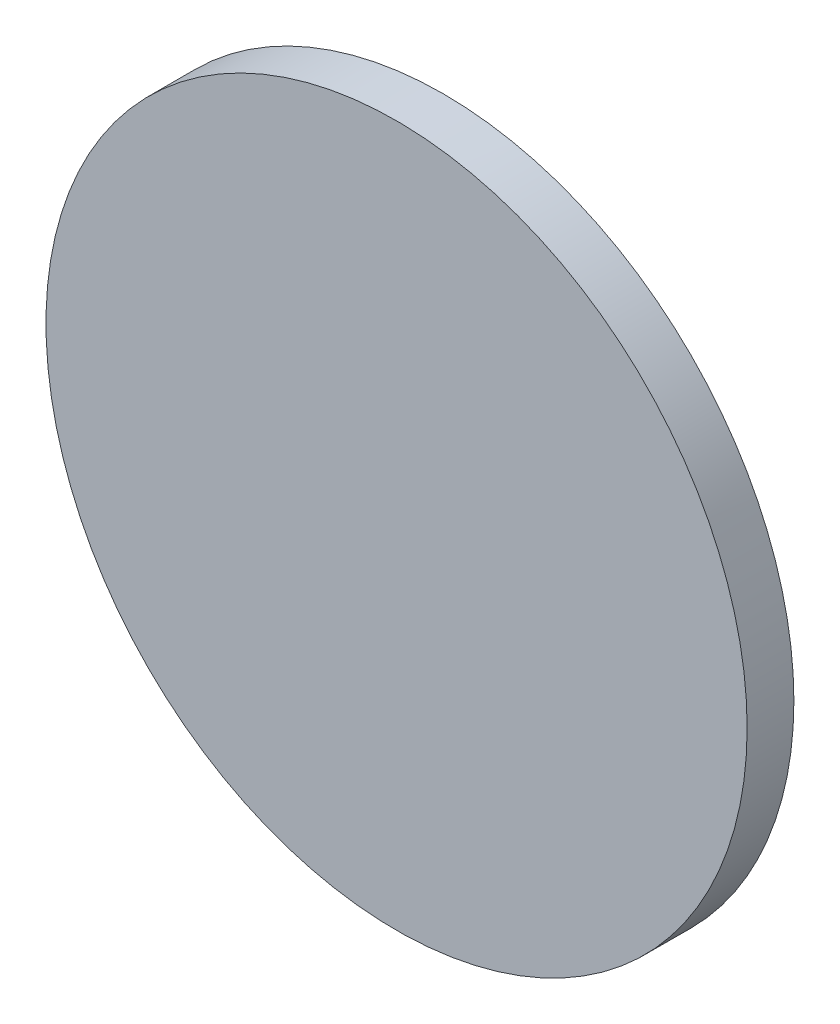
ISO-10303-21;
HEADER;
FILE_DESCRIPTION(('STEP AP214'),'2;1');
FILE_NAME('part.step','',(''),(''),'','','');
FILE_SCHEMA(('AUTOMOTIVE_DESIGN { 1 0 10303 214 1 1 1 1 }'));
ENDSEC;
DATA;
#1=APPLICATION_CONTEXT('core data for automotive mechanical design processes');
#2=APPLICATION_PROTOCOL_DEFINITION('international standard','automotive_design',2000,#1);
#3=PRODUCT_CONTEXT('',#1,'mechanical');
#4=PRODUCT('Part','Part','',(#3));
#5=PRODUCT_RELATED_PRODUCT_CATEGORY('part','',(#4));
#6=PRODUCT_DEFINITION_FORMATION('','',#4);
#7=PRODUCT_DEFINITION_CONTEXT('part definition',#1,'design');
#8=PRODUCT_DEFINITION('design','',#6,#7);
#9=PRODUCT_DEFINITION_SHAPE('','',#8);
#10=(LENGTH_UNIT() NAMED_UNIT(*) SI_UNIT(.MILLI.,.METRE.));
#11=(NAMED_UNIT(*) PLANE_ANGLE_UNIT() SI_UNIT($,.RADIAN.));
#12=(NAMED_UNIT(*) SI_UNIT($,.STERADIAN.) SOLID_ANGLE_UNIT());
#13=UNCERTAINTY_MEASURE_WITH_UNIT(LENGTH_MEASURE(1.E-05),#10,'distance_accuracy_value','');
#14=(GEOMETRIC_REPRESENTATION_CONTEXT(3) GLOBAL_UNCERTAINTY_ASSIGNED_CONTEXT((#13)) GLOBAL_UNIT_ASSIGNED_CONTEXT((#10,
#11,#12)) REPRESENTATION_CONTEXT('',''));
#15=CARTESIAN_POINT('',(0.,0.,0.));
#16=DIRECTION('',(0.,0.,1.));
#17=DIRECTION('',(1.,0.,0.));
#18=AXIS2_PLACEMENT_3D('',#15,#16,#17);
#19=CARTESIAN_POINT('',(0.,0.,0.));
#20=DIRECTION('',(0.,0.,-1.));
#21=DIRECTION('',(-1.,0.,0.));
#22=AXIS2_PLACEMENT_3D('',#19,#20,#21);
#23=PLANE('',#22);
#24=DIRECTION('',(0.,-1.,0.));
#25=VECTOR('',#24,1.);
#26=CARTESIAN_POINT('',(-30.,30.0000000000043,0.));
#27=LINE('',#26,#25);
#28=CARTESIAN_POINT('',(-30.,30.0000000000043,0.));
#29=VERTEX_POINT('',#28);
#30=CARTESIAN_POINT('',(-30.,-30.0000000000043,0.));
#31=VERTEX_POINT('',#30);
#32=EDGE_CURVE('E129',#29,#31,#27,.T.);
#33=ORIENTED_EDGE('',*,*,#32,.F.);
#34=DIRECTION('',(-1.,0.,0.));
#35=VECTOR('',#34,1.);
#36=CARTESIAN_POINT('',(30.,30.0000000000043,0.));
#37=LINE('',#36,#35);
#38=CARTESIAN_POINT('',(30.,30.0000000000043,0.));
#39=VERTEX_POINT('',#38);
#40=EDGE_CURVE('E12',#39,#29,#37,.T.);
#41=ORIENTED_EDGE('',*,*,#40,.F.);
#42=DIRECTION('',(0.,1.,0.));
#43=VECTOR('',#42,1.);
#44=CARTESIAN_POINT('',(30.,30.0000000000043,0.));
#45=LINE('',#44,#43);
#46=CARTESIAN_POINT('',(30.,-30.0000000000043,0.));
#47=VERTEX_POINT('',#46);
#48=EDGE_CURVE('E76',#47,#39,#45,.T.);
#49=ORIENTED_EDGE('',*,*,#48,.F.);
#50=DIRECTION('',(1.,0.,0.));
#51=VECTOR('',#50,1.);
#52=CARTESIAN_POINT('',(30.,-30.0000000000043,0.));
#53=LINE('',#52,#51);
#54=EDGE_CURVE('E161',#31,#47,#53,.T.);
#55=ORIENTED_EDGE('',*,*,#54,.F.);
#56=EDGE_LOOP('',(#33,#41,#49,#55));
#57=FACE_BOUND('',#56,.T.);
#58=ADVANCED_FACE('F66',(#57),#23,.T.);
#59=CARTESIAN_POINT('',(106.066017177974,106.06601717799,49.9999999999991));
#60=CARTESIAN_POINT('',(30.,30.0000000000043,0.));
#61=CARTESIAN_POINT('',(109.191017177975,102.94101717799,49.9999999999991));
#62=CARTESIAN_POINT('',(30.,28.7500000000042,0.));
#63=CARTESIAN_POINT('',(112.235265431033,99.6202265203617,49.9999999999991));
#64=CARTESIAN_POINT('',(30.,27.500000000004,0.));
#65=CARTESIAN_POINT('',(118.099680166964,92.5927096633603,49.9999999999991));
#66=CARTESIAN_POINT('',(30.,25.0000000000036,0.));
#67=CARTESIAN_POINT('',(120.919757392993,88.8859332510844,49.9999999999991));
#68=CARTESIAN_POINT('',(30.,23.7500000000034,0.));
#69=CARTESIAN_POINT('',(126.271003288155,81.1044424584698,49.9999999999991));
#70=CARTESIAN_POINT('',(30.,21.2500000000031,0.));
#71=CARTESIAN_POINT('',(128.802062567297,77.0297020395459,49.9999999999991));
#72=CARTESIAN_POINT('',(30.,20.0000000000029,0.));
#73=CARTESIAN_POINT('',(133.511326145519,68.5439429034832,49.9999999999991));
#74=CARTESIAN_POINT('',(30.,17.5000000000025,0.));
#75=CARTESIAN_POINT('',(135.689408632806,64.1329306847736,49.9999999999991));
#76=CARTESIAN_POINT('',(30.,16.2500000000024,0.));
#77=CARTESIAN_POINT('',(139.633154766966,55.0202735649589,49.9999999999991));
#78=CARTESIAN_POINT('',(30.,13.750000000002,0.));
#79=CARTESIAN_POINT('',(141.398695614746,50.3186731436626,49.9999999999991));
#80=CARTESIAN_POINT('',(30.,12.5000000000018,0.));
#81=CARTESIAN_POINT('',(144.465894233579,40.6837239173444,49.9999999999991));
#82=CARTESIAN_POINT('',(30.,10.0000000000014,0.));
#83=CARTESIAN_POINT('',(145.767442055279,35.7504583133114,49.9999999999991));
#84=CARTESIAN_POINT('',(30.,8.75000000000127,0.));
#85=CARTESIAN_POINT('',(147.866836691358,25.7223840233019,49.9999999999991));
#86=CARTESIAN_POINT('',(30.,6.2500000000009,0.));
#87=CARTESIAN_POINT('',(148.66460040903,20.6276922204669,49.9999999999991));
#88=CARTESIAN_POINT('',(30.,5.00000000000072,0.));
#89=CARTESIAN_POINT('',(149.73120445378,10.3552650347039,49.9999999999991));
#90=CARTESIAN_POINT('',(30.,2.50000000000036,0.));
#91=CARTESIAN_POINT('',(150.,5.17766952966426,49.9999999999991));
#92=CARTESIAN_POINT('',(30.,1.25000000000018,0.));
#93=CARTESIAN_POINT('',(150.,-5.17766952966418,49.9999999999991));
#94=CARTESIAN_POINT('',(30.,-1.25000000000018,0.));
#95=CARTESIAN_POINT('',(149.73120445378,-10.3552650347038,49.9999999999991));
#96=CARTESIAN_POINT('',(30.,-2.50000000000036,0.));
#97=CARTESIAN_POINT('',(148.66460040903,-20.6276922204668,49.9999999999991));
#98=CARTESIAN_POINT('',(30.,-5.00000000000072,0.));
#99=CARTESIAN_POINT('',(147.866836691358,-25.7223840233018,49.9999999999991));
#100=CARTESIAN_POINT('',(30.,-6.2500000000009,0.));
#101=CARTESIAN_POINT('',(145.767442055279,-35.7504583133113,49.9999999999991));
#102=CARTESIAN_POINT('',(30.,-8.75000000000126,0.));
#103=CARTESIAN_POINT('',(144.465894233579,-40.6837239173443,49.9999999999991));
#104=CARTESIAN_POINT('',(30.,-10.0000000000014,0.));
#105=CARTESIAN_POINT('',(141.398695614746,-50.3186731436625,49.9999999999991));
#106=CARTESIAN_POINT('',(30.,-12.5000000000018,0.));
#107=CARTESIAN_POINT('',(139.633154766966,-55.0202735649588,49.9999999999991));
#108=CARTESIAN_POINT('',(30.,-13.750000000002,0.));
#109=CARTESIAN_POINT('',(135.689408632806,-64.1329306847735,49.9999999999991));
#110=CARTESIAN_POINT('',(30.,-16.2500000000024,0.));
#111=CARTESIAN_POINT('',(133.511326145519,-68.5439429034831,49.9999999999991));
#112=CARTESIAN_POINT('',(30.,-17.5000000000025,0.));
#113=CARTESIAN_POINT('',(128.802062567297,-77.0297020395458,49.9999999999991));
#114=CARTESIAN_POINT('',(30.,-20.0000000000029,0.));
#115=CARTESIAN_POINT('',(126.271003288155,-81.1044424584697,49.9999999999991));
#116=CARTESIAN_POINT('',(30.,-21.2500000000031,0.));
#117=CARTESIAN_POINT('',(120.919757392993,-88.8859332510843,49.9999999999991));
#118=CARTESIAN_POINT('',(30.,-23.7500000000034,0.));
#119=CARTESIAN_POINT('',(118.099680166964,-92.5927096633602,49.9999999999991));
#120=CARTESIAN_POINT('',(30.,-25.0000000000036,0.));
#121=CARTESIAN_POINT('',(112.235265431033,-99.6202265203616,49.9999999999991));
#122=CARTESIAN_POINT('',(30.,-27.500000000004,0.));
#123=CARTESIAN_POINT('',(109.191017177975,-102.94101717799,49.9999999999991));
#124=CARTESIAN_POINT('',(30.,-28.7500000000042,0.));
#125=CARTESIAN_POINT('',(106.066017177974,-106.06601717799,49.9999999999991));
#126=CARTESIAN_POINT('',(30.,-30.0000000000043,0.));
#127=B_SPLINE_SURFACE_WITH_KNOTS('',3,1,((#59,#60),(#61,#62),(#63,#64),(#65,#66),(#67,#68),(#69,
#70),(#71,#72),(#73,#74),(#75,#76),(#77,#78),(#79,#80),(#81,#82),(#83,#84),(#85,#86),(#87,#88),
(#89,#90),(#91,#92),(#93,#94),(#95,#96),(#97,#98),(#99,#100),(#101,#102),(#103,#104),(#105,
#106),(#107,#108),(#109,#110),(#111,#112),(#113,#114),(#115,#116),(#117,#118),(#119,#120),(#121,
#122),(#123,#124),(#125,#126)),.UNSPECIFIED.,.F.,.F.,.F.,(4,2,2,2,2,2,2,2,2,2,2,2,2,2,2,2,4),(2,
2),(0.,0.0625,0.125,0.1875,0.25,0.3125,0.375,0.4375,0.5,0.5625,0.625,0.6875,0.75,0.8125,0.875,
0.9375,1.),(0.,1.),.UNSPECIFIED.);
#128=CARTESIAN_POINT('',(0.,0.,49.9999999999991));
#129=DIRECTION('',(0.,0.,1.));
#130=DIRECTION('',(1.,0.,0.));
#131=AXIS2_PLACEMENT_3D('',#128,#129,#130);
#132=CIRCLE('',#131,150.);
#133=CARTESIAN_POINT('',(106.066017177974,-106.06601717799,49.9999999999991));
#134=VERTEX_POINT('',#133);
#135=CARTESIAN_POINT('',(106.066017177974,106.06601717799,49.9999999999991));
#136=VERTEX_POINT('',#135);
#137=EDGE_CURVE('E70',#134,#136,#132,.T.);
#138=DIRECTION('',(-0.641226646308447,0.64122664630854,-0.42149350662605));
#139=VECTOR('',#138,1.);
#140=CARTESIAN_POINT('',(68.0330085889872,-68.0330085889971,24.9999999999996));
#141=LINE('',#140,#139);
#142=EDGE_CURVE('E118',#134,#47,#141,.T.);
#143=DIRECTION('',(0.641226646308447,0.641226646308541,0.42149350662605));
#144=VECTOR('',#143,1.);
#145=CARTESIAN_POINT('',(68.0330085889872,68.0330085889971,24.9999999999996));
#146=LINE('',#145,#144);
#147=EDGE_CURVE('E123',#39,#136,#146,.T.);
#148=ORIENTED_EDGE('',*,*,#137,.F.);
#149=ORIENTED_EDGE('',*,*,#142,.T.);
#150=ORIENTED_EDGE('',*,*,#48,.T.);
#151=ORIENTED_EDGE('',*,*,#147,.T.);
#152=EDGE_LOOP('',(#148,#149,#150,#151));
#153=FACE_BOUND('',#152,.T.);
#154=ADVANCED_FACE('F202',(#153),#127,.T.);
#155=CARTESIAN_POINT('',(106.066017177974,-106.06601717799,49.9999999999991));
#156=CARTESIAN_POINT('',(30.,-30.0000000000043,0.));
#157=CARTESIAN_POINT('',(102.941017177974,-109.191017177989,49.9999999999991));
#158=CARTESIAN_POINT('',(28.75,-30.0000000000043,0.));
#159=CARTESIAN_POINT('',(99.6202265203462,-112.235265431047,49.9999999999991));
#160=CARTESIAN_POINT('',(27.5,-30.0000000000043,0.));
#161=CARTESIAN_POINT('',(92.5927096633452,-118.099680166976,49.9999999999991));
#162=CARTESIAN_POINT('',(25.,-30.0000000000043,0.));
#163=CARTESIAN_POINT('',(88.8859332510695,-120.919757393004,49.9999999999991));
#164=CARTESIAN_POINT('',(23.75,-30.0000000000043,0.));
#165=CARTESIAN_POINT('',(81.1044424584556,-126.271003288164,49.9999999999991));
#166=CARTESIAN_POINT('',(21.25,-30.0000000000043,0.));
#167=CARTESIAN_POINT('',(77.0297020395322,-128.802062567305,49.9999999999991));
#168=CARTESIAN_POINT('',(20.,-30.0000000000043,0.));
#169=CARTESIAN_POINT('',(68.5439429034705,-133.511326145525,49.9999999999991));
#170=CARTESIAN_POINT('',(17.5,-30.0000000000043,0.));
#171=CARTESIAN_POINT('',(64.1329306847616,-135.689408632811,49.9999999999991));
#172=CARTESIAN_POINT('',(16.25,-30.0000000000043,0.));
#173=CARTESIAN_POINT('',(55.0202735649483,-139.633154766971,49.9999999999991));
#174=CARTESIAN_POINT('',(13.75,-30.0000000000043,0.));
#175=CARTESIAN_POINT('',(50.3186731436527,-141.398695614749,49.9999999999991));
#176=CARTESIAN_POINT('',(12.5,-30.0000000000043,0.));
#177=CARTESIAN_POINT('',(40.6837239173362,-144.465894233581,49.9999999999991));
#178=CARTESIAN_POINT('',(10.,-30.0000000000043,0.));
#179=CARTESIAN_POINT('',(35.7504583133042,-145.767442055281,49.9999999999991));
#180=CARTESIAN_POINT('',(8.75000000000001,-30.0000000000043,0.));
#181=CARTESIAN_POINT('',(25.7223840232966,-147.866836691359,49.9999999999991));
#182=CARTESIAN_POINT('',(6.25000000000002,-30.0000000000043,0.));
#183=CARTESIAN_POINT('',(20.6276922204626,-148.66460040903,49.9999999999991));
#184=CARTESIAN_POINT('',(5.00000000000002,-30.0000000000043,0.));
#185=CARTESIAN_POINT('',(10.3552650347017,-149.731204453781,49.9999999999991));
#186=CARTESIAN_POINT('',(2.50000000000002,-30.0000000000043,0.));
#187=CARTESIAN_POINT('',(5.17766952966309,-150.,49.9999999999991));
#188=CARTESIAN_POINT('',(1.25000000000001,-30.0000000000043,0.));
#189=CARTESIAN_POINT('',(-5.17766952966322,-150.,49.9999999999991));
#190=CARTESIAN_POINT('',(-1.24999999999999,-30.0000000000043,0.));
#191=CARTESIAN_POINT('',(-10.3552650347018,-149.731204453781,49.9999999999991));
#192=CARTESIAN_POINT('',(-2.49999999999998,-30.0000000000043,0.));
#193=CARTESIAN_POINT('',(-20.6276922204627,-148.66460040903,49.9999999999991));
#194=CARTESIAN_POINT('',(-4.99999999999996,-30.0000000000043,0.));
#195=CARTESIAN_POINT('',(-25.7223840232967,-147.866836691359,49.9999999999991));
#196=CARTESIAN_POINT('',(-6.24999999999996,-30.0000000000043,0.));
#197=CARTESIAN_POINT('',(-35.7504583133043,-145.767442055281,49.9999999999991));
#198=CARTESIAN_POINT('',(-8.74999999999996,-30.0000000000043,0.));
#199=CARTESIAN_POINT('',(-40.6837239173363,-144.465894233581,49.9999999999991));
#200=CARTESIAN_POINT('',(-9.99999999999996,-30.0000000000043,0.));
#201=CARTESIAN_POINT('',(-50.3186731436528,-141.398695614749,49.9999999999991));
#202=CARTESIAN_POINT('',(-12.5,-30.0000000000043,0.));
#203=CARTESIAN_POINT('',(-55.0202735649484,-139.63315476697,49.9999999999991));
#204=CARTESIAN_POINT('',(-13.75,-30.0000000000043,0.));
#205=CARTESIAN_POINT('',(-64.1329306847617,-135.689408632811,49.9999999999991));
#206=CARTESIAN_POINT('',(-16.25,-30.0000000000043,0.));
#207=CARTESIAN_POINT('',(-68.5439429034706,-133.511326145525,49.9999999999991));
#208=CARTESIAN_POINT('',(-17.5,-30.0000000000043,0.));
#209=CARTESIAN_POINT('',(-77.0297020395323,-128.802062567305,49.9999999999991));
#210=CARTESIAN_POINT('',(-20.,-30.0000000000043,0.));
#211=CARTESIAN_POINT('',(-81.1044424584557,-126.271003288164,49.9999999999991));
#212=CARTESIAN_POINT('',(-21.25,-30.0000000000043,0.));
#213=CARTESIAN_POINT('',(-88.8859332510696,-120.919757393004,49.9999999999991));
#214=CARTESIAN_POINT('',(-23.75,-30.0000000000043,0.));
#215=CARTESIAN_POINT('',(-92.5927096633452,-118.099680166976,49.9999999999991));
#216=CARTESIAN_POINT('',(-25.,-30.0000000000043,0.));
#217=CARTESIAN_POINT('',(-99.6202265203463,-112.235265431047,49.9999999999991));
#218=CARTESIAN_POINT('',(-27.5,-30.0000000000043,0.));
#219=CARTESIAN_POINT('',(-102.941017177974,-109.191017177989,49.9999999999991));
#220=CARTESIAN_POINT('',(-28.75,-30.0000000000043,0.));
#221=CARTESIAN_POINT('',(-106.066017177974,-106.06601717799,49.9999999999991));
#222=CARTESIAN_POINT('',(-30.,-30.0000000000043,0.));
#223=B_SPLINE_SURFACE_WITH_KNOTS('',3,1,((#155,#156),(#157,#158),(#159,#160),(#161,#162),(#163,
#164),(#165,#166),(#167,#168),(#169,#170),(#171,#172),(#173,#174),(#175,#176),(#177,#178),(#179,
#180),(#181,#182),(#183,#184),(#185,#186),(#187,#188),(#189,#190),(#191,#192),(#193,#194),(#195,
#196),(#197,#198),(#199,#200),(#201,#202),(#203,#204),(#205,#206),(#207,#208),(#209,#210),(#211,
#212),(#213,#214),(#215,#216),(#217,#218),(#219,#220),(#221,#222)),.UNSPECIFIED.,.F.,.F.,.F.,(4,
2,2,2,2,2,2,2,2,2,2,2,2,2,2,2,4),(2,2),(0.,0.0624999999999999,0.125,0.1875,0.25,0.3125,0.375,
0.4375,0.5,0.5625,0.625,0.6875,0.75,0.8125,0.875,0.9375,1.),(0.,1.),.UNSPECIFIED.);
#224=CARTESIAN_POINT('',(-106.066017177982,-106.066017177982,49.9999999999991));
#225=VERTEX_POINT('',#224);
#226=EDGE_CURVE('E111',#225,#134,#132,.T.);
#227=DIRECTION('',(0.641226646308447,0.64122664630854,-0.42149350662605));
#228=VECTOR('',#227,1.);
#229=CARTESIAN_POINT('',(-68.0330085889872,-68.033008588997,24.9999999999996));
#230=LINE('',#229,#228);
#231=EDGE_CURVE('E116',#225,#31,#230,.T.);
#232=ORIENTED_EDGE('',*,*,#226,.F.);
#233=ORIENTED_EDGE('',*,*,#231,.T.);
#234=ORIENTED_EDGE('',*,*,#54,.T.);
#235=ORIENTED_EDGE('',*,*,#142,.F.);
#236=EDGE_LOOP('',(#232,#233,#234,#235));
#237=FACE_BOUND('',#236,.T.);
#238=ADVANCED_FACE('F114',(#237),#223,.T.);
#239=CARTESIAN_POINT('',(-106.066017177974,106.06601717799,49.9999999999991));
#240=CARTESIAN_POINT('',(-30.,30.0000000000043,0.));
#241=CARTESIAN_POINT('',(-102.941017177974,109.191017177989,49.9999999999991));
#242=CARTESIAN_POINT('',(-28.75,30.0000000000043,0.));
#243=CARTESIAN_POINT('',(-99.6202265203463,112.235265431047,49.9999999999991));
#244=CARTESIAN_POINT('',(-27.5,30.0000000000043,0.));
#245=CARTESIAN_POINT('',(-92.5927096633452,118.099680166976,49.9999999999991));
#246=CARTESIAN_POINT('',(-25.,30.0000000000043,0.));
#247=CARTESIAN_POINT('',(-88.8859332510696,120.919757393004,49.9999999999991));
#248=CARTESIAN_POINT('',(-23.75,30.0000000000043,0.));
#249=CARTESIAN_POINT('',(-81.1044424584557,126.271003288164,49.9999999999991));
#250=CARTESIAN_POINT('',(-21.25,30.0000000000043,0.));
#251=CARTESIAN_POINT('',(-77.0297020395323,128.802062567305,49.9999999999991));
#252=CARTESIAN_POINT('',(-20.,30.0000000000043,0.));
#253=CARTESIAN_POINT('',(-68.5439429034706,133.511326145525,49.9999999999991));
#254=CARTESIAN_POINT('',(-17.5,30.0000000000043,0.));
#255=CARTESIAN_POINT('',(-64.1329306847617,135.689408632811,49.9999999999991));
#256=CARTESIAN_POINT('',(-16.25,30.0000000000043,0.));
#257=CARTESIAN_POINT('',(-55.0202735649484,139.633154766971,49.9999999999991));
#258=CARTESIAN_POINT('',(-13.75,30.0000000000043,0.));
#259=CARTESIAN_POINT('',(-50.3186731436528,141.398695614749,49.9999999999991));
#260=CARTESIAN_POINT('',(-12.5,30.0000000000043,0.));
#261=CARTESIAN_POINT('',(-40.6837239173363,144.465894233581,49.9999999999991));
#262=CARTESIAN_POINT('',(-9.99999999999997,30.0000000000043,0.));
#263=CARTESIAN_POINT('',(-35.7504583133042,145.767442055281,49.9999999999991));
#264=CARTESIAN_POINT('',(-8.74999999999997,30.0000000000043,0.));
#265=CARTESIAN_POINT('',(-25.7223840232966,147.866836691359,49.9999999999991));
#266=CARTESIAN_POINT('',(-6.24999999999997,30.0000000000043,0.));
#267=CARTESIAN_POINT('',(-20.6276922204627,148.66460040903,49.9999999999991));
#268=CARTESIAN_POINT('',(-4.99999999999997,30.0000000000043,0.));
#269=CARTESIAN_POINT('',(-10.3552650347017,149.731204453781,49.9999999999991));
#270=CARTESIAN_POINT('',(-2.49999999999997,30.0000000000043,0.));
#271=CARTESIAN_POINT('',(-5.17766952966318,150.,49.9999999999991));
#272=CARTESIAN_POINT('',(-1.24999999999997,30.0000000000043,0.));
#273=CARTESIAN_POINT('',(5.17766952966314,150.,49.9999999999991));
#274=CARTESIAN_POINT('',(1.25000000000003,30.0000000000043,0.));
#275=CARTESIAN_POINT('',(10.3552650347017,149.731204453781,49.9999999999991));
#276=CARTESIAN_POINT('',(2.50000000000003,30.0000000000043,0.));
#277=CARTESIAN_POINT('',(20.6276922204626,148.66460040903,49.9999999999991));
#278=CARTESIAN_POINT('',(5.00000000000003,30.0000000000043,0.));
#279=CARTESIAN_POINT('',(25.7223840232966,147.866836691359,49.9999999999991));
#280=CARTESIAN_POINT('',(6.25000000000002,30.0000000000043,0.));
#281=CARTESIAN_POINT('',(35.7504583133042,145.767442055281,49.9999999999991));
#282=CARTESIAN_POINT('',(8.75000000000002,30.0000000000043,0.));
#283=CARTESIAN_POINT('',(40.6837239173363,144.465894233581,49.9999999999991));
#284=CARTESIAN_POINT('',(10.,30.0000000000043,0.));
#285=CARTESIAN_POINT('',(50.3186731436528,141.398695614749,49.9999999999991));
#286=CARTESIAN_POINT('',(12.5,30.0000000000043,0.));
#287=CARTESIAN_POINT('',(55.0202735649483,139.633154766971,49.9999999999991));
#288=CARTESIAN_POINT('',(13.75,30.0000000000043,0.));
#289=CARTESIAN_POINT('',(64.1329306847617,135.689408632811,49.9999999999991));
#290=CARTESIAN_POINT('',(16.25,30.0000000000043,0.));
#291=CARTESIAN_POINT('',(68.5439429034706,133.511326145525,49.9999999999991));
#292=CARTESIAN_POINT('',(17.5,30.0000000000043,0.));
#293=CARTESIAN_POINT('',(77.0297020395322,128.802062567305,49.9999999999991));
#294=CARTESIAN_POINT('',(20.,30.0000000000043,0.));
#295=CARTESIAN_POINT('',(81.1044424584557,126.271003288164,49.9999999999991));
#296=CARTESIAN_POINT('',(21.25,30.0000000000043,0.));
#297=CARTESIAN_POINT('',(88.8859332510695,120.919757393004,49.9999999999991));
#298=CARTESIAN_POINT('',(23.75,30.0000000000043,0.));
#299=CARTESIAN_POINT('',(92.5927096633452,118.099680166976,49.9999999999991));
#300=CARTESIAN_POINT('',(25.,30.0000000000043,0.));
#301=CARTESIAN_POINT('',(99.6202265203463,112.235265431047,49.9999999999991));
#302=CARTESIAN_POINT('',(27.5,30.0000000000043,0.));
#303=CARTESIAN_POINT('',(102.941017177974,109.191017177989,49.9999999999991));
#304=CARTESIAN_POINT('',(28.75,30.0000000000043,0.));
#305=CARTESIAN_POINT('',(106.066017177974,106.06601717799,49.9999999999991));
#306=CARTESIAN_POINT('',(30.,30.0000000000043,0.));
#307=B_SPLINE_SURFACE_WITH_KNOTS('',3,1,((#239,#240),(#241,#242),(#243,#244),(#245,#246),(#247,
#248),(#249,#250),(#251,#252),(#253,#254),(#255,#256),(#257,#258),(#259,#260),(#261,#262),(#263,
#264),(#265,#266),(#267,#268),(#269,#270),(#271,#272),(#273,#274),(#275,#276),(#277,#278),(#279,
#280),(#281,#282),(#283,#284),(#285,#286),(#287,#288),(#289,#290),(#291,#292),(#293,#294),(#295,
#296),(#297,#298),(#299,#300),(#301,#302),(#303,#304),(#305,#306)),.UNSPECIFIED.,.F.,.F.,.F.,(4,
2,2,2,2,2,2,2,2,2,2,2,2,2,2,2,4),(2,2),(0.,0.0624999999999999,0.125,0.1875,0.25,0.3125,0.375,
0.4375,0.5,0.5625,0.625,0.6875,0.75,0.8125,0.875,0.9375,1.),(0.,1.),.UNSPECIFIED.);
#308=CARTESIAN_POINT('',(-106.066017177974,106.06601717799,49.9999999999991));
#309=VERTEX_POINT('',#308);
#310=EDGE_CURVE('E136',#136,#309,#132,.T.);
#311=DIRECTION('',(0.641226646308447,-0.64122664630854,-0.42149350662605));
#312=VECTOR('',#311,1.);
#313=CARTESIAN_POINT('',(-68.0330085889872,68.0330085889971,24.9999999999996));
#314=LINE('',#313,#312);
#315=EDGE_CURVE('E84',#309,#29,#314,.T.);
#316=ORIENTED_EDGE('',*,*,#310,.F.);
#317=ORIENTED_EDGE('',*,*,#147,.F.);
#318=ORIENTED_EDGE('',*,*,#40,.T.);
#319=ORIENTED_EDGE('',*,*,#315,.F.);
#320=EDGE_LOOP('',(#316,#317,#318,#319));
#321=FACE_BOUND('',#320,.T.);
#322=ADVANCED_FACE('F254',(#321),#307,.T.);
#323=CARTESIAN_POINT('',(-106.066017177974,-106.06601717799,49.9999999999991));
#324=CARTESIAN_POINT('',(-30.,-30.0000000000043,0.));
#325=CARTESIAN_POINT('',(-109.191017177975,-102.94101717799,49.9999999999991));
#326=CARTESIAN_POINT('',(-30.,-28.7500000000042,0.));
#327=CARTESIAN_POINT('',(-112.235265431033,-99.6202265203615,49.9999999999991));
#328=CARTESIAN_POINT('',(-30.,-27.500000000004,0.));
#329=CARTESIAN_POINT('',(-118.099680166964,-92.5927096633601,49.9999999999991));
#330=CARTESIAN_POINT('',(-30.,-25.0000000000036,0.));
#331=CARTESIAN_POINT('',(-120.919757392993,-88.8859332510842,49.9999999999991));
#332=CARTESIAN_POINT('',(-30.,-23.7500000000035,0.));
#333=CARTESIAN_POINT('',(-126.271003288155,-81.1044424584696,49.9999999999991));
#334=CARTESIAN_POINT('',(-30.,-21.2500000000031,0.));
#335=CARTESIAN_POINT('',(-128.802062567297,-77.0297020395457,49.9999999999991));
#336=CARTESIAN_POINT('',(-30.,-20.0000000000029,0.));
#337=CARTESIAN_POINT('',(-133.511326145519,-68.543942903483,49.9999999999991));
#338=CARTESIAN_POINT('',(-30.,-17.5000000000026,0.));
#339=CARTESIAN_POINT('',(-135.689408632806,-64.1329306847735,49.9999999999991));
#340=CARTESIAN_POINT('',(-30.,-16.2500000000024,0.));
#341=CARTESIAN_POINT('',(-139.633154766966,-55.0202735649588,49.9999999999991));
#342=CARTESIAN_POINT('',(-30.,-13.7500000000021,0.));
#343=CARTESIAN_POINT('',(-141.398695614746,-50.3186731436625,49.9999999999991));
#344=CARTESIAN_POINT('',(-30.,-12.5000000000019,0.));
#345=CARTESIAN_POINT('',(-144.465894233579,-40.6837239173443,49.9999999999991));
#346=CARTESIAN_POINT('',(-30.,-10.0000000000015,0.));
#347=CARTESIAN_POINT('',(-145.767442055279,-35.7504583133113,49.9999999999991));
#348=CARTESIAN_POINT('',(-30.,-8.75000000000135,0.));
#349=CARTESIAN_POINT('',(-147.866836691358,-25.7223840233017,49.9999999999991));
#350=CARTESIAN_POINT('',(-30.,-6.25000000000099,0.));
#351=CARTESIAN_POINT('',(-148.66460040903,-20.6276922204668,49.9999999999991));
#352=CARTESIAN_POINT('',(-30.,-5.00000000000081,0.));
#353=CARTESIAN_POINT('',(-149.73120445378,-10.3552650347038,49.9999999999991));
#354=CARTESIAN_POINT('',(-30.,-2.50000000000045,0.));
#355=CARTESIAN_POINT('',(-150.,-5.17766952966415,49.9999999999991));
#356=CARTESIAN_POINT('',(-30.,-1.25000000000027,0.));
#357=CARTESIAN_POINT('',(-150.,5.17766952966429,49.9999999999991));
#358=CARTESIAN_POINT('',(-30.,1.25000000000009,0.));
#359=CARTESIAN_POINT('',(-149.73120445378,10.3552650347039,49.9999999999991));
#360=CARTESIAN_POINT('',(-30.,2.50000000000027,0.));
#361=CARTESIAN_POINT('',(-148.66460040903,20.6276922204669,49.9999999999991));
#362=CARTESIAN_POINT('',(-30.,5.00000000000064,0.));
#363=CARTESIAN_POINT('',(-147.866836691358,25.7223840233019,49.9999999999991));
#364=CARTESIAN_POINT('',(-30.,6.25000000000082,0.));
#365=CARTESIAN_POINT('',(-145.767442055279,35.7504583133114,49.9999999999991));
#366=CARTESIAN_POINT('',(-30.,8.75000000000118,0.));
#367=CARTESIAN_POINT('',(-144.465894233579,40.6837239173444,49.9999999999991));
#368=CARTESIAN_POINT('',(-30.,10.0000000000014,0.));
#369=CARTESIAN_POINT('',(-141.398695614746,50.3186731436626,49.9999999999991));
#370=CARTESIAN_POINT('',(-30.,12.5000000000017,0.));
#371=CARTESIAN_POINT('',(-139.633154766966,55.0202735649589,49.9999999999991));
#372=CARTESIAN_POINT('',(-30.,13.7500000000019,0.));
#373=CARTESIAN_POINT('',(-135.689408632806,64.1329306847736,49.9999999999991));
#374=CARTESIAN_POINT('',(-30.,16.2500000000023,0.));
#375=CARTESIAN_POINT('',(-133.511326145519,68.5439429034832,49.9999999999991));
#376=CARTESIAN_POINT('',(-30.,17.5000000000025,0.));
#377=CARTESIAN_POINT('',(-128.802062567297,77.0297020395459,49.9999999999991));
#378=CARTESIAN_POINT('',(-30.,20.0000000000028,0.));
#379=CARTESIAN_POINT('',(-126.271003288155,81.1044424584697,49.9999999999991));
#380=CARTESIAN_POINT('',(-30.,21.250000000003,0.));
#381=CARTESIAN_POINT('',(-120.919757392993,88.8859332510843,49.9999999999991));
#382=CARTESIAN_POINT('',(-30.,23.7500000000034,0.));
#383=CARTESIAN_POINT('',(-118.099680166964,92.5927096633602,49.9999999999991));
#384=CARTESIAN_POINT('',(-30.,25.0000000000036,0.));
#385=CARTESIAN_POINT('',(-112.235265431033,99.6202265203617,49.9999999999991));
#386=CARTESIAN_POINT('',(-30.,27.500000000004,0.));
#387=CARTESIAN_POINT('',(-109.191017177975,102.94101717799,49.9999999999991));
#388=CARTESIAN_POINT('',(-30.,28.7500000000041,0.));
#389=CARTESIAN_POINT('',(-106.066017177974,106.06601717799,49.9999999999991));
#390=CARTESIAN_POINT('',(-30.,30.0000000000043,0.));
#391=B_SPLINE_SURFACE_WITH_KNOTS('',3,1,((#323,#324),(#325,#326),(#327,#328),(#329,#330),(#331,
#332),(#333,#334),(#335,#336),(#337,#338),(#339,#340),(#341,#342),(#343,#344),(#345,#346),(#347,
#348),(#349,#350),(#351,#352),(#353,#354),(#355,#356),(#357,#358),(#359,#360),(#361,#362),(#363,
#364),(#365,#366),(#367,#368),(#369,#370),(#371,#372),(#373,#374),(#375,#376),(#377,#378),(#379,
#380),(#381,#382),(#383,#384),(#385,#386),(#387,#388),(#389,#390)),.UNSPECIFIED.,.F.,.F.,.F.,(4,
2,2,2,2,2,2,2,2,2,2,2,2,2,2,2,4),(2,2),(0.,0.0625,0.125,0.1875,0.25,0.3125,0.375,0.4375,0.5,
0.5625,0.625,0.6875,0.75,0.8125,0.875,0.9375,1.),(0.,1.),.UNSPECIFIED.);
#392=EDGE_CURVE('E127',#309,#225,#132,.T.);
#393=ORIENTED_EDGE('',*,*,#392,.F.);
#394=ORIENTED_EDGE('',*,*,#315,.T.);
#395=ORIENTED_EDGE('',*,*,#32,.T.);
#396=ORIENTED_EDGE('',*,*,#231,.F.);
#397=EDGE_LOOP('',(#393,#394,#395,#396));
#398=FACE_BOUND('',#397,.T.);
#399=ADVANCED_FACE('F126',(#398),#391,.T.);
#400=CARTESIAN_POINT('',(0.,0.,69.9999999999991));
#401=DIRECTION('',(0.,0.,-1.));
#402=DIRECTION('',(-1.,0.,0.));
#403=AXIS2_PLACEMENT_3D('',#400,#401,#402);
#404=CYLINDRICAL_SURFACE('',#403,150.);
#405=ORIENTED_EDGE('',*,*,#310,.T.);
#406=ORIENTED_EDGE('',*,*,#392,.T.);
#407=ORIENTED_EDGE('',*,*,#226,.T.);
#408=ORIENTED_EDGE('',*,*,#137,.T.);
#409=EDGE_LOOP('',(#405,#406,#407,#408));
#410=FACE_BOUND('',#409,.T.);
#411=CARTESIAN_POINT('',(0.,0.,69.9999999999991));
#412=DIRECTION('',(0.,0.,1.));
#413=DIRECTION('',(1.,0.,0.));
#414=AXIS2_PLACEMENT_3D('',#411,#412,#413);
#415=CIRCLE('',#414,150.);
#416=CARTESIAN_POINT('',(150.,0.,69.9999999999991));
#417=VERTEX_POINT('',#416);
#418=EDGE_CURVE('E138',#417,#417,#415,.T.);
#419=ORIENTED_EDGE('',*,*,#418,.F.);
#420=EDGE_LOOP('',(#419));
#421=FACE_BOUND('',#420,.T.);
#422=ADVANCED_FACE('F134',(#410,#421),#404,.T.);
#423=CARTESIAN_POINT('',(0.,0.,69.9999999999991));
#424=DIRECTION('',(0.,0.,1.));
#425=DIRECTION('',(1.,0.,0.));
#426=AXIS2_PLACEMENT_3D('',#423,#424,#425);
#427=PLANE('',#426);
#428=ORIENTED_EDGE('',*,*,#418,.T.);
#429=EDGE_LOOP('',(#428));
#430=FACE_BOUND('',#429,.T.);
#431=ADVANCED_FACE('F325',(#430),#427,.T.);
#432=CLOSED_SHELL('',(#58,#154,#238,#322,#399,#422,#431));
#433=MANIFOLD_SOLID_BREP('B2',#432);
#434=ADVANCED_BREP_SHAPE_REPRESENTATION('',(#18,#433),#14);
#435=SHAPE_DEFINITION_REPRESENTATION(#9,#434);
ENDSEC;
END-ISO-10303-21;
